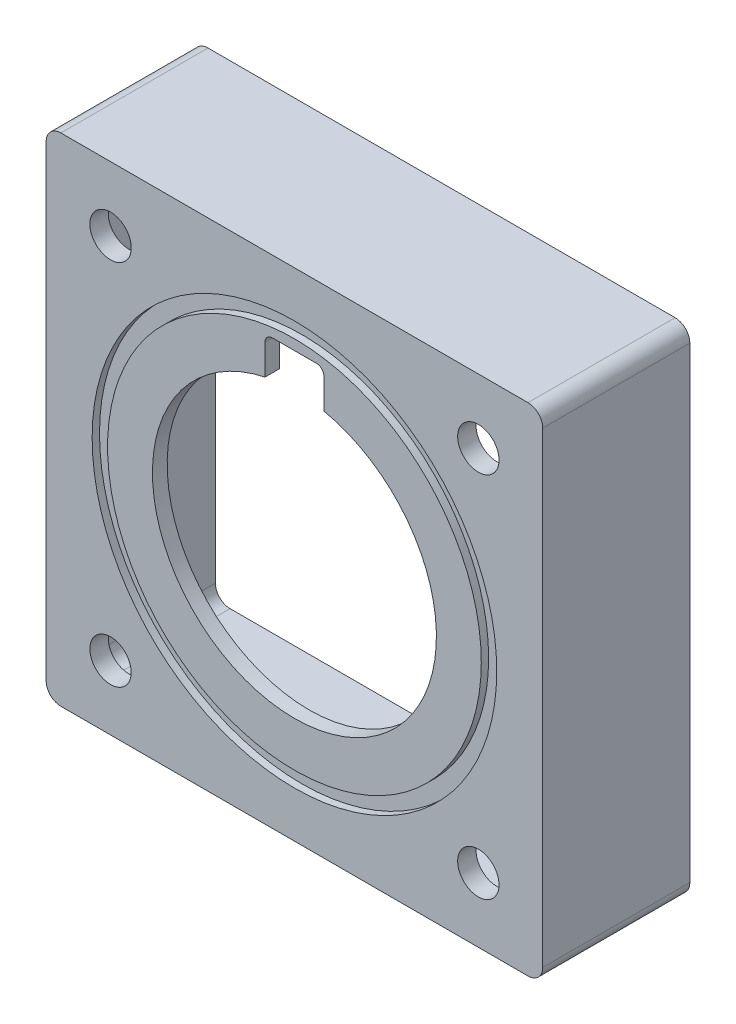
ISO-10303-21;
HEADER;
FILE_DESCRIPTION(('STEP AP214'),'2;1');
FILE_NAME('part.step','',(''),(''),'','','');
FILE_SCHEMA(('AUTOMOTIVE_DESIGN { 1 0 10303 214 1 1 1 1 }'));
ENDSEC;
DATA;
#1=APPLICATION_CONTEXT('core data for automotive mechanical design processes');
#2=APPLICATION_PROTOCOL_DEFINITION('international standard','automotive_design',2000,#1);
#3=PRODUCT_CONTEXT('',#1,'mechanical');
#4=PRODUCT('Part','Part','',(#3));
#5=PRODUCT_RELATED_PRODUCT_CATEGORY('part','',(#4));
#6=PRODUCT_DEFINITION_FORMATION('','',#4);
#7=PRODUCT_DEFINITION_CONTEXT('part definition',#1,'design');
#8=PRODUCT_DEFINITION('design','',#6,#7);
#9=PRODUCT_DEFINITION_SHAPE('','',#8);
#10=(LENGTH_UNIT() NAMED_UNIT(*) SI_UNIT(.MILLI.,.METRE.));
#11=(NAMED_UNIT(*) PLANE_ANGLE_UNIT() SI_UNIT($,.RADIAN.));
#12=(NAMED_UNIT(*) SI_UNIT($,.STERADIAN.) SOLID_ANGLE_UNIT());
#13=UNCERTAINTY_MEASURE_WITH_UNIT(LENGTH_MEASURE(1.E-05),#10,'distance_accuracy_value','');
#14=(GEOMETRIC_REPRESENTATION_CONTEXT(3) GLOBAL_UNCERTAINTY_ASSIGNED_CONTEXT((#13)) GLOBAL_UNIT_ASSIGNED_CONTEXT((#10,
#11,#12)) REPRESENTATION_CONTEXT('',''));
#15=CARTESIAN_POINT('',(0.,0.,0.));
#16=DIRECTION('',(0.,0.,1.));
#17=DIRECTION('',(1.,0.,0.));
#18=AXIS2_PLACEMENT_3D('',#15,#16,#17);
#19=CARTESIAN_POINT('',(0.,0.,25.4));
#20=DIRECTION('',(0.,0.,-1.));
#21=DIRECTION('',(-1.,0.,0.));
#22=AXIS2_PLACEMENT_3D('',#19,#20,#21);
#23=CYLINDRICAL_SURFACE('',#22,24.511);
#24=DIRECTION('',(0.,0.,-1.));
#25=VECTOR('',#24,1.);
#26=CARTESIAN_POINT('',(5.08,23.9787973218008,25.4));
#27=LINE('',#26,#25);
#28=CARTESIAN_POINT('',(5.08,23.9787973218008,22.86));
#29=VERTEX_POINT('',#28);
#30=CARTESIAN_POINT('',(5.08,23.9787973218008,25.4));
#31=VERTEX_POINT('',#30);
#32=EDGE_CURVE('E416',#29,#31,#27,.F.);
#33=ORIENTED_EDGE('',*,*,#32,.F.);
#34=CARTESIAN_POINT('',(0.,0.,22.86));
#35=DIRECTION('',(0.,0.,-1.));
#36=DIRECTION('',(-1.,0.,0.));
#37=AXIS2_PLACEMENT_3D('',#34,#35,#36);
#38=CIRCLE('',#37,24.511);
#39=CARTESIAN_POINT('',(-5.08,23.9787973218008,22.86));
#40=VERTEX_POINT('',#39);
#41=EDGE_CURVE('E54',#29,#40,#38,.T.);
#42=ORIENTED_EDGE('',*,*,#41,.T.);
#43=DIRECTION('',(0.,0.,-1.));
#44=VECTOR('',#43,1.);
#45=CARTESIAN_POINT('',(-5.08,23.9787973218008,25.4));
#46=LINE('',#45,#44);
#47=CARTESIAN_POINT('',(-5.08,23.9787973218008,25.4));
#48=VERTEX_POINT('',#47);
#49=EDGE_CURVE('E412',#48,#40,#46,.T.);
#50=ORIENTED_EDGE('',*,*,#49,.F.);
#51=CARTESIAN_POINT('',(0.,0.,25.4));
#52=DIRECTION('',(0.,0.,1.));
#53=DIRECTION('',(1.,0.,0.));
#54=AXIS2_PLACEMENT_3D('',#51,#52,#53);
#55=CIRCLE('',#54,24.511);
#56=EDGE_CURVE('E346',#48,#31,#55,.T.);
#57=ORIENTED_EDGE('',*,*,#56,.T.);
#58=EDGE_LOOP('',(#33,#42,#50,#57));
#59=FACE_BOUND('',#58,.T.);
#60=ADVANCED_FACE('F39',(#59),#23,.F.);
#61=CARTESIAN_POINT('',(0.,0.,25.4));
#62=DIRECTION('',(0.,0.,1.));
#63=DIRECTION('',(1.,0.,0.));
#64=AXIS2_PLACEMENT_3D('',#61,#62,#63);
#65=PLANE('',#64);
#66=DIRECTION('',(0.,-1.,0.));
#67=VECTOR('',#66,1.);
#68=CARTESIAN_POINT('',(-5.08,19.05,25.4));
#69=LINE('',#68,#67);
#70=CARTESIAN_POINT('',(-5.08,29.21,25.4));
#71=VERTEX_POINT('',#70);
#72=EDGE_CURVE('E218',#71,#48,#69,.T.);
#73=ORIENTED_EDGE('',*,*,#72,.F.);
#74=CARTESIAN_POINT('',(-3.81,29.21,25.4));
#75=DIRECTION('',(0.,0.,1.));
#76=DIRECTION('',(1.,0.,0.));
#77=AXIS2_PLACEMENT_3D('',#74,#75,#76);
#78=CIRCLE('',#77,1.27);
#79=CARTESIAN_POINT('',(-3.81,30.48,25.4));
#80=VERTEX_POINT('',#79);
#81=EDGE_CURVE('E62',#71,#80,#78,.F.);
#82=ORIENTED_EDGE('',*,*,#81,.T.);
#83=DIRECTION('',(-1.,0.,0.));
#84=VECTOR('',#83,1.);
#85=CARTESIAN_POINT('',(-5.08,30.48,25.4));
#86=LINE('',#85,#84);
#87=CARTESIAN_POINT('',(3.81,30.48,25.4));
#88=VERTEX_POINT('',#87);
#89=EDGE_CURVE('E418',#88,#80,#86,.T.);
#90=ORIENTED_EDGE('',*,*,#89,.F.);
#91=CARTESIAN_POINT('',(3.81,29.21,25.4));
#92=DIRECTION('',(0.,0.,1.));
#93=DIRECTION('',(1.,0.,0.));
#94=AXIS2_PLACEMENT_3D('',#91,#92,#93);
#95=CIRCLE('',#94,1.27);
#96=CARTESIAN_POINT('',(5.08,29.21,25.4));
#97=VERTEX_POINT('',#96);
#98=EDGE_CURVE('E241',#88,#97,#95,.F.);
#99=ORIENTED_EDGE('',*,*,#98,.T.);
#100=DIRECTION('',(0.,1.,0.));
#101=VECTOR('',#100,1.);
#102=CARTESIAN_POINT('',(5.08,30.48,25.4));
#103=LINE('',#102,#101);
#104=EDGE_CURVE('E421',#31,#97,#103,.T.);
#105=ORIENTED_EDGE('',*,*,#104,.F.);
#106=ORIENTED_EDGE('',*,*,#56,.F.);
#107=EDGE_LOOP('',(#73,#82,#90,#99,#105,#106));
#108=FACE_BOUND('',#107,.T.);
#109=CARTESIAN_POINT('',(0.,0.,25.4));
#110=DIRECTION('',(0.,0.,1.));
#111=DIRECTION('',(1.,0.,0.));
#112=AXIS2_PLACEMENT_3D('',#109,#110,#111);
#113=CIRCLE('',#112,32.258);
#114=CARTESIAN_POINT('',(32.258,0.,25.4));
#115=VERTEX_POINT('',#114);
#116=EDGE_CURVE('E409',#115,#115,#113,.T.);
#117=ORIENTED_EDGE('',*,*,#116,.T.);
#118=EDGE_LOOP('',(#117));
#119=FACE_BOUND('',#118,.T.);
#120=ADVANCED_FACE('F430',(#108,#119),#65,.T.);
#121=CARTESIAN_POINT('',(0.,0.,25.4));
#122=DIRECTION('',(0.,0.,1.));
#123=DIRECTION('',(1.,0.,0.));
#124=AXIS2_PLACEMENT_3D('',#121,#122,#123);
#125=CIRCLE('',#124,34.925);
#126=CARTESIAN_POINT('',(34.925,0.,25.4));
#127=VERTEX_POINT('',#126);
#128=EDGE_CURVE('E403',#127,#127,#125,.T.);
#129=ORIENTED_EDGE('',*,*,#128,.F.);
#130=EDGE_LOOP('',(#129));
#131=FACE_BOUND('',#130,.T.);
#132=CARTESIAN_POINT('',(31.75,31.7499999999996,25.4));
#133=DIRECTION('',(0.,0.,-1.));
#134=DIRECTION('',(-1.,0.,0.));
#135=AXIS2_PLACEMENT_3D('',#132,#133,#134);
#136=CIRCLE('',#135,3.57245345743552);
#137=CARTESIAN_POINT('',(28.1775465425645,31.7499999999996,25.4));
#138=VERTEX_POINT('',#137);
#139=EDGE_CURVE('E362',#138,#138,#136,.T.);
#140=ORIENTED_EDGE('',*,*,#139,.T.);
#141=EDGE_LOOP('',(#140));
#142=FACE_BOUND('',#141,.T.);
#143=CARTESIAN_POINT('',(-31.75,31.7499999999996,25.4));
#144=DIRECTION('',(0.,0.,1.));
#145=DIRECTION('',(1.,0.,0.));
#146=AXIS2_PLACEMENT_3D('',#143,#144,#145);
#147=CIRCLE('',#146,3.57245345743552);
#148=CARTESIAN_POINT('',(-28.1775465425645,31.7499999999996,25.4));
#149=VERTEX_POINT('',#148);
#150=EDGE_CURVE('E359',#149,#149,#147,.T.);
#151=ORIENTED_EDGE('',*,*,#150,.F.);
#152=EDGE_LOOP('',(#151));
#153=FACE_BOUND('',#152,.T.);
#154=DIRECTION('',(1.,0.,0.));
#155=VECTOR('',#154,1.);
#156=CARTESIAN_POINT('',(-42.8625,-42.8625,25.4));
#157=LINE('',#156,#155);
#158=CARTESIAN_POINT('',(-40.3225,-42.8625,25.4));
#159=VERTEX_POINT('',#158);
#160=CARTESIAN_POINT('',(40.3225,-42.8625,25.4));
#161=VERTEX_POINT('',#160);
#162=EDGE_CURVE('E352',#159,#161,#157,.T.);
#163=ORIENTED_EDGE('',*,*,#162,.T.);
#164=CARTESIAN_POINT('',(40.3225,-40.3225,25.4));
#165=DIRECTION('',(0.,0.,1.));
#166=DIRECTION('',(1.,0.,0.));
#167=AXIS2_PLACEMENT_3D('',#164,#165,#166);
#168=CIRCLE('',#167,2.54);
#169=CARTESIAN_POINT('',(42.8625,-40.3225,25.4));
#170=VERTEX_POINT('',#169);
#171=EDGE_CURVE('E301',#161,#170,#168,.T.);
#172=ORIENTED_EDGE('',*,*,#171,.T.);
#173=DIRECTION('',(0.,1.,0.));
#174=VECTOR('',#173,1.);
#175=CARTESIAN_POINT('',(42.8625,42.8625,25.4));
#176=LINE('',#175,#174);
#177=CARTESIAN_POINT('',(42.8625,40.3225,25.4));
#178=VERTEX_POINT('',#177);
#179=EDGE_CURVE('E349',#170,#178,#176,.T.);
#180=ORIENTED_EDGE('',*,*,#179,.T.);
#181=CARTESIAN_POINT('',(40.3225,40.3225,25.4));
#182=DIRECTION('',(0.,0.,1.));
#183=DIRECTION('',(1.,0.,0.));
#184=AXIS2_PLACEMENT_3D('',#181,#182,#183);
#185=CIRCLE('',#184,2.54);
#186=CARTESIAN_POINT('',(40.3225,42.8625,25.4));
#187=VERTEX_POINT('',#186);
#188=EDGE_CURVE('E307',#178,#187,#185,.T.);
#189=ORIENTED_EDGE('',*,*,#188,.T.);
#190=DIRECTION('',(-1.,0.,0.));
#191=VECTOR('',#190,1.);
#192=CARTESIAN_POINT('',(-42.8625,42.8625,25.4));
#193=LINE('',#192,#191);
#194=CARTESIAN_POINT('',(-40.3225,42.8625,25.4));
#195=VERTEX_POINT('',#194);
#196=EDGE_CURVE('E327',#187,#195,#193,.T.);
#197=ORIENTED_EDGE('',*,*,#196,.T.);
#198=CARTESIAN_POINT('',(-40.3225,40.3225,25.4));
#199=DIRECTION('',(0.,0.,1.));
#200=DIRECTION('',(1.,0.,0.));
#201=AXIS2_PLACEMENT_3D('',#198,#199,#200);
#202=CIRCLE('',#201,2.54);
#203=CARTESIAN_POINT('',(-42.8625,40.3225,25.4));
#204=VERTEX_POINT('',#203);
#205=EDGE_CURVE('E305',#195,#204,#202,.T.);
#206=ORIENTED_EDGE('',*,*,#205,.T.);
#207=DIRECTION('',(0.,-1.,0.));
#208=VECTOR('',#207,1.);
#209=CARTESIAN_POINT('',(-42.8625,42.8625,25.4));
#210=LINE('',#209,#208);
#211=CARTESIAN_POINT('',(-42.8625,-40.3225,25.4));
#212=VERTEX_POINT('',#211);
#213=EDGE_CURVE('E336',#204,#212,#210,.T.);
#214=ORIENTED_EDGE('',*,*,#213,.T.);
#215=CARTESIAN_POINT('',(-40.3225,-40.3225,25.4));
#216=DIRECTION('',(0.,0.,1.));
#217=DIRECTION('',(1.,0.,0.));
#218=AXIS2_PLACEMENT_3D('',#215,#216,#217);
#219=CIRCLE('',#218,2.54);
#220=EDGE_CURVE('E303',#212,#159,#219,.T.);
#221=ORIENTED_EDGE('',*,*,#220,.T.);
#222=EDGE_LOOP('',(#163,#172,#180,#189,#197,#206,#214,#221));
#223=FACE_BOUND('',#222,.T.);
#224=CARTESIAN_POINT('',(31.75,-31.7499999999996,25.4));
#225=DIRECTION('',(0.,0.,1.));
#226=DIRECTION('',(-1.,0.,0.));
#227=AXIS2_PLACEMENT_3D('',#224,#225,#226);
#228=CIRCLE('',#227,3.57245345743552);
#229=CARTESIAN_POINT('',(28.1775465425645,-31.7499999999996,25.4));
#230=VERTEX_POINT('',#229);
#231=EDGE_CURVE('E365',#230,#230,#228,.T.);
#232=ORIENTED_EDGE('',*,*,#231,.F.);
#233=EDGE_LOOP('',(#232));
#234=FACE_BOUND('',#233,.T.);
#235=CARTESIAN_POINT('',(-31.75,-31.7499999999996,25.4));
#236=DIRECTION('',(0.,0.,-1.));
#237=DIRECTION('',(1.,0.,0.));
#238=AXIS2_PLACEMENT_3D('',#235,#236,#237);
#239=CIRCLE('',#238,3.57245345743552);
#240=CARTESIAN_POINT('',(-28.1775465425645,-31.7499999999996,25.4));
#241=VERTEX_POINT('',#240);
#242=EDGE_CURVE('E368',#241,#241,#239,.T.);
#243=ORIENTED_EDGE('',*,*,#242,.T.);
#244=EDGE_LOOP('',(#243));
#245=FACE_BOUND('',#244,.T.);
#246=ADVANCED_FACE('F451',(#131,#142,#153,#223,#234,#245),#65,.T.);
#247=CARTESIAN_POINT('',(0.,0.,0.));
#248=DIRECTION('',(0.,0.,1.));
#249=DIRECTION('',(1.,0.,0.));
#250=AXIS2_PLACEMENT_3D('',#247,#248,#249);
#251=PLANE('',#250);
#252=DIRECTION('',(0.,1.,0.));
#253=VECTOR('',#252,1.);
#254=CARTESIAN_POINT('',(-39.0525,39.0525,0.));
#255=LINE('',#254,#253);
#256=CARTESIAN_POINT('',(-39.0525,-36.5125,0.));
#257=VERTEX_POINT('',#256);
#258=CARTESIAN_POINT('',(-39.0525,36.5125,0.));
#259=VERTEX_POINT('',#258);
#260=EDGE_CURVE('E398',#257,#259,#255,.T.);
#261=ORIENTED_EDGE('',*,*,#260,.F.);
#262=CARTESIAN_POINT('',(-36.5125,-36.5125,0.));
#263=DIRECTION('',(0.,0.,1.));
#264=DIRECTION('',(1.,0.,0.));
#265=AXIS2_PLACEMENT_3D('',#262,#263,#264);
#266=CIRCLE('',#265,2.54);
#267=CARTESIAN_POINT('',(-36.5125,-39.0525,0.));
#268=VERTEX_POINT('',#267);
#269=EDGE_CURVE('E255',#257,#268,#266,.T.);
#270=ORIENTED_EDGE('',*,*,#269,.T.);
#271=DIRECTION('',(-1.,0.,0.));
#272=VECTOR('',#271,1.);
#273=CARTESIAN_POINT('',(39.0525,-39.0525,0.));
#274=LINE('',#273,#272);
#275=CARTESIAN_POINT('',(36.5125,-39.0525,0.));
#276=VERTEX_POINT('',#275);
#277=EDGE_CURVE('E394',#276,#268,#274,.T.);
#278=ORIENTED_EDGE('',*,*,#277,.F.);
#279=CARTESIAN_POINT('',(36.5125,-36.5125,0.));
#280=DIRECTION('',(0.,0.,1.));
#281=DIRECTION('',(1.,0.,0.));
#282=AXIS2_PLACEMENT_3D('',#279,#280,#281);
#283=CIRCLE('',#282,2.54);
#284=CARTESIAN_POINT('',(39.0525,-36.5125,0.));
#285=VERTEX_POINT('',#284);
#286=EDGE_CURVE('E259',#276,#285,#283,.T.);
#287=ORIENTED_EDGE('',*,*,#286,.T.);
#288=DIRECTION('',(0.,-1.,0.));
#289=VECTOR('',#288,1.);
#290=CARTESIAN_POINT('',(39.0525,39.0525,0.));
#291=LINE('',#290,#289);
#292=CARTESIAN_POINT('',(39.0525,36.5125,0.));
#293=VERTEX_POINT('',#292);
#294=EDGE_CURVE('E391',#293,#285,#291,.T.);
#295=ORIENTED_EDGE('',*,*,#294,.F.);
#296=CARTESIAN_POINT('',(36.5125,36.5125,0.));
#297=DIRECTION('',(0.,0.,1.));
#298=DIRECTION('',(1.,0.,0.));
#299=AXIS2_PLACEMENT_3D('',#296,#297,#298);
#300=CIRCLE('',#299,2.54);
#301=CARTESIAN_POINT('',(36.5125,39.0525,0.));
#302=VERTEX_POINT('',#301);
#303=EDGE_CURVE('E261',#293,#302,#300,.T.);
#304=ORIENTED_EDGE('',*,*,#303,.T.);
#305=DIRECTION('',(1.,0.,0.));
#306=VECTOR('',#305,1.);
#307=CARTESIAN_POINT('',(39.0525,39.0525,0.));
#308=LINE('',#307,#306);
#309=CARTESIAN_POINT('',(-36.5125,39.0525,0.));
#310=VERTEX_POINT('',#309);
#311=EDGE_CURVE('E390',#310,#302,#308,.T.);
#312=ORIENTED_EDGE('',*,*,#311,.F.);
#313=CARTESIAN_POINT('',(-36.5125,36.5125,0.));
#314=DIRECTION('',(0.,0.,1.));
#315=DIRECTION('',(1.,0.,0.));
#316=AXIS2_PLACEMENT_3D('',#313,#314,#315);
#317=CIRCLE('',#316,2.54);
#318=EDGE_CURVE('E254',#310,#259,#317,.T.);
#319=ORIENTED_EDGE('',*,*,#318,.T.);
#320=EDGE_LOOP('',(#261,#270,#278,#287,#295,#304,#312,#319));
#321=FACE_BOUND('',#320,.T.);
#322=DIRECTION('',(0.,1.,0.));
#323=VECTOR('',#322,1.);
#324=CARTESIAN_POINT('',(42.8625,42.8625,0.));
#325=LINE('',#324,#323);
#326=CARTESIAN_POINT('',(42.8625,-40.3225,0.));
#327=VERTEX_POINT('',#326);
#328=CARTESIAN_POINT('',(42.8625,40.3225,0.));
#329=VERTEX_POINT('',#328);
#330=EDGE_CURVE('E337',#327,#329,#325,.T.);
#331=ORIENTED_EDGE('',*,*,#330,.F.);
#332=CARTESIAN_POINT('',(40.3225,-40.3225,0.));
#333=DIRECTION('',(0.,0.,1.));
#334=DIRECTION('',(1.,0.,0.));
#335=AXIS2_PLACEMENT_3D('',#332,#333,#334);
#336=CIRCLE('',#335,2.54);
#337=CARTESIAN_POINT('',(40.3225,-42.8625,0.));
#338=VERTEX_POINT('',#337);
#339=EDGE_CURVE('E314',#327,#338,#336,.F.);
#340=ORIENTED_EDGE('',*,*,#339,.T.);
#341=DIRECTION('',(1.,0.,0.));
#342=VECTOR('',#341,1.);
#343=CARTESIAN_POINT('',(-42.8625,-42.8625,0.));
#344=LINE('',#343,#342);
#345=CARTESIAN_POINT('',(-40.3225,-42.8625,0.));
#346=VERTEX_POINT('',#345);
#347=EDGE_CURVE('E340',#346,#338,#344,.T.);
#348=ORIENTED_EDGE('',*,*,#347,.F.);
#349=CARTESIAN_POINT('',(-40.3225,-40.3225,0.));
#350=DIRECTION('',(0.,0.,1.));
#351=DIRECTION('',(1.,0.,0.));
#352=AXIS2_PLACEMENT_3D('',#349,#350,#351);
#353=CIRCLE('',#352,2.54);
#354=CARTESIAN_POINT('',(-42.8625,-40.3225,0.));
#355=VERTEX_POINT('',#354);
#356=EDGE_CURVE('E316',#346,#355,#353,.F.);
#357=ORIENTED_EDGE('',*,*,#356,.T.);
#358=DIRECTION('',(0.,-1.,0.));
#359=VECTOR('',#358,1.);
#360=CARTESIAN_POINT('',(-42.8625,42.8625,0.));
#361=LINE('',#360,#359);
#362=CARTESIAN_POINT('',(-42.8625,40.3225,0.));
#363=VERTEX_POINT('',#362);
#364=EDGE_CURVE('E343',#363,#355,#361,.T.);
#365=ORIENTED_EDGE('',*,*,#364,.F.);
#366=CARTESIAN_POINT('',(-40.3225,40.3225,0.));
#367=DIRECTION('',(0.,0.,1.));
#368=DIRECTION('',(1.,0.,0.));
#369=AXIS2_PLACEMENT_3D('',#366,#367,#368);
#370=CIRCLE('',#369,2.54);
#371=CARTESIAN_POINT('',(-40.3225,42.8625,0.));
#372=VERTEX_POINT('',#371);
#373=EDGE_CURVE('E318',#363,#372,#370,.F.);
#374=ORIENTED_EDGE('',*,*,#373,.T.);
#375=DIRECTION('',(-1.,0.,0.));
#376=VECTOR('',#375,1.);
#377=CARTESIAN_POINT('',(-42.8625,42.8625,0.));
#378=LINE('',#377,#376);
#379=CARTESIAN_POINT('',(40.3225,42.8625,0.));
#380=VERTEX_POINT('',#379);
#381=EDGE_CURVE('E333',#380,#372,#378,.T.);
#382=ORIENTED_EDGE('',*,*,#381,.F.);
#383=CARTESIAN_POINT('',(40.3225,40.3225,0.));
#384=DIRECTION('',(0.,0.,1.));
#385=DIRECTION('',(1.,0.,0.));
#386=AXIS2_PLACEMENT_3D('',#383,#384,#385);
#387=CIRCLE('',#386,2.54);
#388=EDGE_CURVE('E320',#380,#329,#387,.F.);
#389=ORIENTED_EDGE('',*,*,#388,.T.);
#390=EDGE_LOOP('',(#331,#340,#348,#357,#365,#374,#382,#389));
#391=FACE_BOUND('',#390,.T.);
#392=ADVANCED_FACE('F458',(#321,#391),#251,.F.);
#393=CARTESIAN_POINT('',(-42.8625,42.8625,25.4));
#394=DIRECTION('',(1.,0.,0.));
#395=DIRECTION('',(0.,1.,0.));
#396=AXIS2_PLACEMENT_3D('',#393,#394,#395);
#397=PLANE('',#396);
#398=ORIENTED_EDGE('',*,*,#364,.T.);
#399=DIRECTION('',(0.,0.,-1.));
#400=VECTOR('',#399,1.);
#401=CARTESIAN_POINT('',(-42.8625,-40.3225,25.4));
#402=LINE('',#401,#400);
#403=EDGE_CURVE('E296',#355,#212,#402,.F.);
#404=ORIENTED_EDGE('',*,*,#403,.T.);
#405=ORIENTED_EDGE('',*,*,#213,.F.);
#406=DIRECTION('',(0.,0.,-1.));
#407=VECTOR('',#406,1.);
#408=CARTESIAN_POINT('',(-42.8625,40.3225,25.4));
#409=LINE('',#408,#407);
#410=EDGE_CURVE('E298',#204,#363,#409,.T.);
#411=ORIENTED_EDGE('',*,*,#410,.T.);
#412=EDGE_LOOP('',(#398,#404,#405,#411));
#413=FACE_BOUND('',#412,.T.);
#414=ADVANCED_FACE('F462',(#413),#397,.F.);
#415=CARTESIAN_POINT('',(-42.8625,-42.8625,25.4));
#416=DIRECTION('',(0.,1.,0.));
#417=DIRECTION('',(-1.,0.,0.));
#418=AXIS2_PLACEMENT_3D('',#415,#416,#417);
#419=PLANE('',#418);
#420=ORIENTED_EDGE('',*,*,#347,.T.);
#421=DIRECTION('',(0.,0.,-1.));
#422=VECTOR('',#421,1.);
#423=CARTESIAN_POINT('',(40.3225,-42.8625,25.4));
#424=LINE('',#423,#422);
#425=EDGE_CURVE('E309',#338,#161,#424,.F.);
#426=ORIENTED_EDGE('',*,*,#425,.T.);
#427=ORIENTED_EDGE('',*,*,#162,.F.);
#428=DIRECTION('',(0.,0.,-1.));
#429=VECTOR('',#428,1.);
#430=CARTESIAN_POINT('',(-40.3225,-42.8625,25.4));
#431=LINE('',#430,#429);
#432=EDGE_CURVE('E311',#159,#346,#431,.T.);
#433=ORIENTED_EDGE('',*,*,#432,.T.);
#434=EDGE_LOOP('',(#420,#426,#427,#433));
#435=FACE_BOUND('',#434,.T.);
#436=ADVANCED_FACE('F471',(#435),#419,.F.);
#437=CARTESIAN_POINT('',(42.8625,42.8625,25.4));
#438=DIRECTION('',(-1.,0.,0.));
#439=DIRECTION('',(0.,-1.,0.));
#440=AXIS2_PLACEMENT_3D('',#437,#438,#439);
#441=PLANE('',#440);
#442=ORIENTED_EDGE('',*,*,#179,.F.);
#443=DIRECTION('',(0.,0.,-1.));
#444=VECTOR('',#443,1.);
#445=CARTESIAN_POINT('',(42.8625,-40.3225,25.4));
#446=LINE('',#445,#444);
#447=EDGE_CURVE('E322',#170,#327,#446,.T.);
#448=ORIENTED_EDGE('',*,*,#447,.T.);
#449=ORIENTED_EDGE('',*,*,#330,.T.);
#450=DIRECTION('',(0.,0.,-1.));
#451=VECTOR('',#450,1.);
#452=CARTESIAN_POINT('',(42.8625,40.3225,25.4));
#453=LINE('',#452,#451);
#454=EDGE_CURVE('E325',#329,#178,#453,.F.);
#455=ORIENTED_EDGE('',*,*,#454,.T.);
#456=EDGE_LOOP('',(#442,#448,#449,#455));
#457=FACE_BOUND('',#456,.T.);
#458=ADVANCED_FACE('F467',(#457),#441,.F.);
#459=CARTESIAN_POINT('',(-42.8625,42.8625,25.4));
#460=DIRECTION('',(0.,-1.,0.));
#461=DIRECTION('',(0.,0.,-1.));
#462=AXIS2_PLACEMENT_3D('',#459,#460,#461);
#463=PLANE('',#462);
#464=ORIENTED_EDGE('',*,*,#381,.T.);
#465=DIRECTION('',(0.,0.,-1.));
#466=VECTOR('',#465,1.);
#467=CARTESIAN_POINT('',(-40.3225,42.8625,25.4));
#468=LINE('',#467,#466);
#469=EDGE_CURVE('E291',#372,#195,#468,.F.);
#470=ORIENTED_EDGE('',*,*,#469,.T.);
#471=ORIENTED_EDGE('',*,*,#196,.F.);
#472=DIRECTION('',(0.,0.,-1.));
#473=VECTOR('',#472,1.);
#474=CARTESIAN_POINT('',(40.3225,42.8625,25.4));
#475=LINE('',#474,#473);
#476=EDGE_CURVE('E293',#187,#380,#475,.T.);
#477=ORIENTED_EDGE('',*,*,#476,.T.);
#478=EDGE_LOOP('',(#464,#470,#471,#477));
#479=FACE_BOUND('',#478,.T.);
#480=ADVANCED_FACE('F464',(#479),#463,.F.);
#481=CARTESIAN_POINT('',(-31.75,31.7499999999996,0.));
#482=DIRECTION('',(0.,0.,1.));
#483=DIRECTION('',(1.,0.,0.));
#484=AXIS2_PLACEMENT_3D('',#481,#482,#483);
#485=CYLINDRICAL_SURFACE('',#484,3.57245345743552);
#486=CARTESIAN_POINT('',(-31.75,31.7499999999996,22.225));
#487=DIRECTION('',(0.,0.,1.));
#488=DIRECTION('',(1.,0.,0.));
#489=AXIS2_PLACEMENT_3D('',#486,#487,#488);
#490=CIRCLE('',#489,3.57245345743552);
#491=CARTESIAN_POINT('',(-28.1775465425645,31.7499999999996,22.225));
#492=VERTEX_POINT('',#491);
#493=EDGE_CURVE('E371',#492,#492,#490,.F.);
#494=ORIENTED_EDGE('',*,*,#493,.T.);
#495=EDGE_LOOP('',(#494));
#496=FACE_BOUND('',#495,.T.);
#497=ORIENTED_EDGE('',*,*,#150,.T.);
#498=EDGE_LOOP('',(#497));
#499=FACE_BOUND('',#498,.T.);
#500=ADVANCED_FACE('F454',(#496,#499),#485,.F.);
#501=CARTESIAN_POINT('',(31.75,31.7499999999996,0.));
#502=DIRECTION('',(0.,0.,1.));
#503=DIRECTION('',(1.,0.,0.));
#504=AXIS2_PLACEMENT_3D('',#501,#502,#503);
#505=CYLINDRICAL_SURFACE('',#504,3.57245345743552);
#506=CARTESIAN_POINT('',(31.75,31.7499999999996,22.225));
#507=DIRECTION('',(0.,0.,1.));
#508=DIRECTION('',(1.,0.,0.));
#509=AXIS2_PLACEMENT_3D('',#506,#507,#508);
#510=CIRCLE('',#509,3.57245345743552);
#511=CARTESIAN_POINT('',(35.3224534574355,31.7499999999996,22.225));
#512=VERTEX_POINT('',#511);
#513=EDGE_CURVE('E374',#512,#512,#510,.T.);
#514=ORIENTED_EDGE('',*,*,#513,.F.);
#515=EDGE_LOOP('',(#514));
#516=FACE_BOUND('',#515,.T.);
#517=ORIENTED_EDGE('',*,*,#139,.F.);
#518=EDGE_LOOP('',(#517));
#519=FACE_BOUND('',#518,.T.);
#520=ADVANCED_FACE('F584',(#516,#519),#505,.F.);
#521=CARTESIAN_POINT('',(31.75,-31.7499999999996,0.));
#522=DIRECTION('',(0.,0.,1.));
#523=DIRECTION('',(1.,0.,0.));
#524=AXIS2_PLACEMENT_3D('',#521,#522,#523);
#525=CYLINDRICAL_SURFACE('',#524,3.57245345743552);
#526=CARTESIAN_POINT('',(31.75,-31.7499999999996,22.225));
#527=DIRECTION('',(0.,0.,1.));
#528=DIRECTION('',(1.,0.,0.));
#529=AXIS2_PLACEMENT_3D('',#526,#527,#528);
#530=CIRCLE('',#529,3.57245345743552);
#531=CARTESIAN_POINT('',(35.3224534574355,-31.7499999999996,22.225));
#532=VERTEX_POINT('',#531);
#533=EDGE_CURVE('E331',#532,#532,#530,.F.);
#534=ORIENTED_EDGE('',*,*,#533,.T.);
#535=EDGE_LOOP('',(#534));
#536=FACE_BOUND('',#535,.T.);
#537=ORIENTED_EDGE('',*,*,#231,.T.);
#538=EDGE_LOOP('',(#537));
#539=FACE_BOUND('',#538,.T.);
#540=ADVANCED_FACE('F576',(#536,#539),#525,.F.);
#541=CARTESIAN_POINT('',(-31.75,-31.7499999999996,0.));
#542=DIRECTION('',(0.,0.,1.));
#543=DIRECTION('',(1.,0.,0.));
#544=AXIS2_PLACEMENT_3D('',#541,#542,#543);
#545=CYLINDRICAL_SURFACE('',#544,3.57245345743552);
#546=CARTESIAN_POINT('',(-31.75,-31.7499999999996,22.225));
#547=DIRECTION('',(0.,0.,1.));
#548=DIRECTION('',(1.,0.,0.));
#549=AXIS2_PLACEMENT_3D('',#546,#547,#548);
#550=CIRCLE('',#549,3.57245345743552);
#551=CARTESIAN_POINT('',(-28.1775465425645,-31.7499999999996,22.225));
#552=VERTEX_POINT('',#551);
#553=EDGE_CURVE('E328',#552,#552,#550,.T.);
#554=ORIENTED_EDGE('',*,*,#553,.F.);
#555=EDGE_LOOP('',(#554));
#556=FACE_BOUND('',#555,.T.);
#557=ORIENTED_EDGE('',*,*,#242,.F.);
#558=EDGE_LOOP('',(#557));
#559=FACE_BOUND('',#558,.T.);
#560=ADVANCED_FACE('F574',(#556,#559),#545,.F.);
#561=CARTESIAN_POINT('',(0.,0.,22.225));
#562=DIRECTION('',(0.,0.,1.));
#563=DIRECTION('',(1.,0.,0.));
#564=AXIS2_PLACEMENT_3D('',#561,#562,#563);
#565=PLANE('',#564);
#566=DIRECTION('',(0.,-1.,0.));
#567=VECTOR('',#566,1.);
#568=CARTESIAN_POINT('',(-5.08,0.,22.225));
#569=LINE('',#568,#567);
#570=CARTESIAN_POINT('',(-5.08,29.21,22.225));
#571=VERTEX_POINT('',#570);
#572=CARTESIAN_POINT('',(-5.08,28.1585349691705,22.225));
#573=VERTEX_POINT('',#572);
#574=EDGE_CURVE('E215',#571,#573,#569,.T.);
#575=ORIENTED_EDGE('',*,*,#574,.T.);
#576=CARTESIAN_POINT('',(0.,0.,22.225));
#577=DIRECTION('',(0.,0.,-1.));
#578=DIRECTION('',(-1.,0.,0.));
#579=AXIS2_PLACEMENT_3D('',#576,#577,#578);
#580=CIRCLE('',#579,28.6131);
#581=CARTESIAN_POINT('',(5.08,28.1585349691705,22.225));
#582=VERTEX_POINT('',#581);
#583=EDGE_CURVE('E200',#582,#573,#580,.T.);
#584=ORIENTED_EDGE('',*,*,#583,.F.);
#585=DIRECTION('',(0.,1.,0.));
#586=VECTOR('',#585,1.);
#587=CARTESIAN_POINT('',(5.08,0.,22.225));
#588=LINE('',#587,#586);
#589=CARTESIAN_POINT('',(5.08,29.21,22.225));
#590=VERTEX_POINT('',#589);
#591=EDGE_CURVE('E230',#582,#590,#588,.T.);
#592=ORIENTED_EDGE('',*,*,#591,.T.);
#593=CARTESIAN_POINT('',(3.81,29.21,22.225));
#594=DIRECTION('',(0.,0.,1.));
#595=DIRECTION('',(1.,0.,0.));
#596=AXIS2_PLACEMENT_3D('',#593,#594,#595);
#597=CIRCLE('',#596,1.27);
#598=CARTESIAN_POINT('',(3.81,30.48,22.225));
#599=VERTEX_POINT('',#598);
#600=EDGE_CURVE('E243',#590,#599,#597,.T.);
#601=ORIENTED_EDGE('',*,*,#600,.T.);
#602=DIRECTION('',(-1.,0.,0.));
#603=VECTOR('',#602,1.);
#604=CARTESIAN_POINT('',(0.,30.48,22.225));
#605=LINE('',#604,#603);
#606=CARTESIAN_POINT('',(-3.81,30.48,22.225));
#607=VERTEX_POINT('',#606);
#608=EDGE_CURVE('E226',#599,#607,#605,.T.);
#609=ORIENTED_EDGE('',*,*,#608,.T.);
#610=CARTESIAN_POINT('',(-3.81,29.21,22.225));
#611=DIRECTION('',(0.,0.,1.));
#612=DIRECTION('',(1.,0.,0.));
#613=AXIS2_PLACEMENT_3D('',#610,#611,#612);
#614=CIRCLE('',#613,1.27);
#615=EDGE_CURVE('E224',#607,#571,#614,.T.);
#616=ORIENTED_EDGE('',*,*,#615,.T.);
#617=EDGE_LOOP('',(#575,#584,#592,#601,#609,#616));
#618=FACE_BOUND('',#617,.T.);
#619=ORIENTED_EDGE('',*,*,#533,.F.);
#620=EDGE_LOOP('',(#619));
#621=FACE_BOUND('',#620,.T.);
#622=ORIENTED_EDGE('',*,*,#553,.T.);
#623=EDGE_LOOP('',(#622));
#624=FACE_BOUND('',#623,.T.);
#625=DIRECTION('',(1.,0.,0.));
#626=VECTOR('',#625,1.);
#627=CARTESIAN_POINT('',(39.0525,39.0525,22.225));
#628=LINE('',#627,#626);
#629=CARTESIAN_POINT('',(-36.5125,39.0525,22.225));
#630=VERTEX_POINT('',#629);
#631=CARTESIAN_POINT('',(36.5125,39.0525,22.225));
#632=VERTEX_POINT('',#631);
#633=EDGE_CURVE('E382',#630,#632,#628,.T.);
#634=ORIENTED_EDGE('',*,*,#633,.T.);
#635=CARTESIAN_POINT('',(36.5125,36.5125,22.225));
#636=DIRECTION('',(0.,0.,1.));
#637=DIRECTION('',(1.,0.,0.));
#638=AXIS2_PLACEMENT_3D('',#635,#636,#637);
#639=CIRCLE('',#638,2.54);
#640=CARTESIAN_POINT('',(39.0525,36.5125,22.225));
#641=VERTEX_POINT('',#640);
#642=EDGE_CURVE('E273',#632,#641,#639,.F.);
#643=ORIENTED_EDGE('',*,*,#642,.T.);
#644=DIRECTION('',(0.,-1.,0.));
#645=VECTOR('',#644,1.);
#646=CARTESIAN_POINT('',(39.0525,39.0525,22.225));
#647=LINE('',#646,#645);
#648=CARTESIAN_POINT('',(39.0525,-36.5125,22.225));
#649=VERTEX_POINT('',#648);
#650=EDGE_CURVE('E332',#641,#649,#647,.T.);
#651=ORIENTED_EDGE('',*,*,#650,.T.);
#652=CARTESIAN_POINT('',(36.5125,-36.5125,22.225));
#653=DIRECTION('',(0.,0.,1.));
#654=DIRECTION('',(1.,0.,0.));
#655=AXIS2_PLACEMENT_3D('',#652,#653,#654);
#656=CIRCLE('',#655,2.54);
#657=CARTESIAN_POINT('',(36.5125,-39.0525,22.225));
#658=VERTEX_POINT('',#657);
#659=EDGE_CURVE('E275',#649,#658,#656,.F.);
#660=ORIENTED_EDGE('',*,*,#659,.T.);
#661=DIRECTION('',(-1.,0.,0.));
#662=VECTOR('',#661,1.);
#663=CARTESIAN_POINT('',(39.0525,-39.0525,22.225));
#664=LINE('',#663,#662);
#665=CARTESIAN_POINT('',(-36.5125,-39.0525,22.225));
#666=VERTEX_POINT('',#665);
#667=EDGE_CURVE('E383',#658,#666,#664,.T.);
#668=ORIENTED_EDGE('',*,*,#667,.T.);
#669=CARTESIAN_POINT('',(-36.5125,-36.5125,22.225));
#670=DIRECTION('',(0.,0.,1.));
#671=DIRECTION('',(1.,0.,0.));
#672=AXIS2_PLACEMENT_3D('',#669,#670,#671);
#673=CIRCLE('',#672,2.54);
#674=CARTESIAN_POINT('',(-39.0525,-36.5125,22.225));
#675=VERTEX_POINT('',#674);
#676=EDGE_CURVE('E277',#666,#675,#673,.F.);
#677=ORIENTED_EDGE('',*,*,#676,.T.);
#678=DIRECTION('',(0.,1.,0.));
#679=VECTOR('',#678,1.);
#680=CARTESIAN_POINT('',(-39.0525,39.0525,22.225));
#681=LINE('',#680,#679);
#682=CARTESIAN_POINT('',(-39.0525,36.5125,22.225));
#683=VERTEX_POINT('',#682);
#684=EDGE_CURVE('E379',#675,#683,#681,.T.);
#685=ORIENTED_EDGE('',*,*,#684,.T.);
#686=CARTESIAN_POINT('',(-36.5125,36.5125,22.225));
#687=DIRECTION('',(0.,0.,1.));
#688=DIRECTION('',(1.,0.,0.));
#689=AXIS2_PLACEMENT_3D('',#686,#687,#688);
#690=CIRCLE('',#689,2.54);
#691=EDGE_CURVE('E279',#683,#630,#690,.F.);
#692=ORIENTED_EDGE('',*,*,#691,.T.);
#693=EDGE_LOOP('',(#634,#643,#651,#660,#668,#677,#685,#692));
#694=FACE_BOUND('',#693,.T.);
#695=ORIENTED_EDGE('',*,*,#513,.T.);
#696=EDGE_LOOP('',(#695));
#697=FACE_BOUND('',#696,.T.);
#698=ORIENTED_EDGE('',*,*,#493,.F.);
#699=EDGE_LOOP('',(#698));
#700=FACE_BOUND('',#699,.T.);
#701=ADVANCED_FACE('F220',(#618,#621,#624,#694,#697,#700),#565,.F.);
#702=CARTESIAN_POINT('',(39.0525,-39.0525,135.857150289151));
#703=DIRECTION('',(0.,-1.,0.));
#704=DIRECTION('',(0.,0.,-1.));
#705=AXIS2_PLACEMENT_3D('',#702,#703,#704);
#706=PLANE('',#705);
#707=ORIENTED_EDGE('',*,*,#667,.F.);
#708=DIRECTION('',(0.,0.,-1.));
#709=VECTOR('',#708,1.);
#710=CARTESIAN_POINT('',(36.5125,-39.0525,0.));
#711=LINE('',#710,#709);
#712=EDGE_CURVE('E268',#658,#276,#711,.T.);
#713=ORIENTED_EDGE('',*,*,#712,.T.);
#714=ORIENTED_EDGE('',*,*,#277,.T.);
#715=DIRECTION('',(0.,0.,-1.));
#716=VECTOR('',#715,1.);
#717=CARTESIAN_POINT('',(-36.5125,-39.0525,22.225));
#718=LINE('',#717,#716);
#719=EDGE_CURVE('E271',#268,#666,#718,.F.);
#720=ORIENTED_EDGE('',*,*,#719,.T.);
#721=EDGE_LOOP('',(#707,#713,#714,#720));
#722=FACE_BOUND('',#721,.T.);
#723=ADVANCED_FACE('F540',(#722),#706,.F.);
#724=CARTESIAN_POINT('',(-39.0525,39.0525,135.857150289151));
#725=DIRECTION('',(-1.,0.,0.));
#726=DIRECTION('',(0.,-1.,0.));
#727=AXIS2_PLACEMENT_3D('',#724,#725,#726);
#728=PLANE('',#727);
#729=ORIENTED_EDGE('',*,*,#684,.F.);
#730=DIRECTION('',(0.,0.,-1.));
#731=VECTOR('',#730,1.);
#732=CARTESIAN_POINT('',(-39.0525,-36.5125,0.));
#733=LINE('',#732,#731);
#734=EDGE_CURVE('E263',#675,#257,#733,.T.);
#735=ORIENTED_EDGE('',*,*,#734,.T.);
#736=ORIENTED_EDGE('',*,*,#260,.T.);
#737=DIRECTION('',(0.,0.,-1.));
#738=VECTOR('',#737,1.);
#739=CARTESIAN_POINT('',(-39.0525,36.5125,22.225));
#740=LINE('',#739,#738);
#741=EDGE_CURVE('E266',#259,#683,#740,.F.);
#742=ORIENTED_EDGE('',*,*,#741,.T.);
#743=EDGE_LOOP('',(#729,#735,#736,#742));
#744=FACE_BOUND('',#743,.T.);
#745=ADVANCED_FACE('F545',(#744),#728,.F.);
#746=CARTESIAN_POINT('',(39.0525,39.0525,135.857150289151));
#747=DIRECTION('',(0.,1.,0.));
#748=DIRECTION('',(0.,0.,1.));
#749=AXIS2_PLACEMENT_3D('',#746,#747,#748);
#750=PLANE('',#749);
#751=ORIENTED_EDGE('',*,*,#311,.T.);
#752=DIRECTION('',(0.,0.,-1.));
#753=VECTOR('',#752,1.);
#754=CARTESIAN_POINT('',(36.5125,39.0525,22.225));
#755=LINE('',#754,#753);
#756=EDGE_CURVE('E281',#302,#632,#755,.F.);
#757=ORIENTED_EDGE('',*,*,#756,.T.);
#758=ORIENTED_EDGE('',*,*,#633,.F.);
#759=DIRECTION('',(0.,0.,-1.));
#760=VECTOR('',#759,1.);
#761=CARTESIAN_POINT('',(-36.5125,39.0525,0.));
#762=LINE('',#761,#760);
#763=EDGE_CURVE('E283',#630,#310,#762,.T.);
#764=ORIENTED_EDGE('',*,*,#763,.T.);
#765=EDGE_LOOP('',(#751,#757,#758,#764));
#766=FACE_BOUND('',#765,.T.);
#767=ADVANCED_FACE('F527',(#766),#750,.F.);
#768=CARTESIAN_POINT('',(39.0525,39.0525,135.857150289151));
#769=DIRECTION('',(1.,0.,0.));
#770=DIRECTION('',(0.,1.,0.));
#771=AXIS2_PLACEMENT_3D('',#768,#769,#770);
#772=PLANE('',#771);
#773=ORIENTED_EDGE('',*,*,#650,.F.);
#774=DIRECTION('',(0.,0.,-1.));
#775=VECTOR('',#774,1.);
#776=CARTESIAN_POINT('',(39.0525,36.5125,0.));
#777=LINE('',#776,#775);
#778=EDGE_CURVE('E286',#641,#293,#777,.T.);
#779=ORIENTED_EDGE('',*,*,#778,.T.);
#780=ORIENTED_EDGE('',*,*,#294,.T.);
#781=DIRECTION('',(0.,0.,-1.));
#782=VECTOR('',#781,1.);
#783=CARTESIAN_POINT('',(39.0525,-36.5125,22.225));
#784=LINE('',#783,#782);
#785=EDGE_CURVE('E289',#285,#649,#784,.F.);
#786=ORIENTED_EDGE('',*,*,#785,.T.);
#787=EDGE_LOOP('',(#773,#779,#780,#786));
#788=FACE_BOUND('',#787,.T.);
#789=ADVANCED_FACE('F483',(#788),#772,.F.);
#790=CARTESIAN_POINT('',(40.3225,-40.3225,25.4));
#791=DIRECTION('',(0.,0.,-1.));
#792=DIRECTION('',(-1.,0.,0.));
#793=AXIS2_PLACEMENT_3D('',#790,#791,#792);
#794=CYLINDRICAL_SURFACE('',#793,2.54);
#795=ORIENTED_EDGE('',*,*,#171,.F.);
#796=ORIENTED_EDGE('',*,*,#425,.F.);
#797=ORIENTED_EDGE('',*,*,#339,.F.);
#798=ORIENTED_EDGE('',*,*,#447,.F.);
#799=EDGE_LOOP('',(#795,#796,#797,#798));
#800=FACE_BOUND('',#799,.T.);
#801=ADVANCED_FACE('F479',(#800),#794,.T.);
#802=CARTESIAN_POINT('',(-40.3225,-40.3225,25.4));
#803=DIRECTION('',(0.,0.,-1.));
#804=DIRECTION('',(-1.,0.,0.));
#805=AXIS2_PLACEMENT_3D('',#802,#803,#804);
#806=CYLINDRICAL_SURFACE('',#805,2.54);
#807=ORIENTED_EDGE('',*,*,#220,.F.);
#808=ORIENTED_EDGE('',*,*,#403,.F.);
#809=ORIENTED_EDGE('',*,*,#356,.F.);
#810=ORIENTED_EDGE('',*,*,#432,.F.);
#811=EDGE_LOOP('',(#807,#808,#809,#810));
#812=FACE_BOUND('',#811,.T.);
#813=ADVANCED_FACE('F482',(#812),#806,.T.);
#814=CARTESIAN_POINT('',(-40.3225,40.3225,25.4));
#815=DIRECTION('',(0.,0.,-1.));
#816=DIRECTION('',(-1.,0.,0.));
#817=AXIS2_PLACEMENT_3D('',#814,#815,#816);
#818=CYLINDRICAL_SURFACE('',#817,2.54);
#819=ORIENTED_EDGE('',*,*,#205,.F.);
#820=ORIENTED_EDGE('',*,*,#469,.F.);
#821=ORIENTED_EDGE('',*,*,#373,.F.);
#822=ORIENTED_EDGE('',*,*,#410,.F.);
#823=EDGE_LOOP('',(#819,#820,#821,#822));
#824=FACE_BOUND('',#823,.T.);
#825=ADVANCED_FACE('F487',(#824),#818,.T.);
#826=CARTESIAN_POINT('',(40.3225,40.3225,25.4));
#827=DIRECTION('',(0.,0.,-1.));
#828=DIRECTION('',(-1.,0.,0.));
#829=AXIS2_PLACEMENT_3D('',#826,#827,#828);
#830=CYLINDRICAL_SURFACE('',#829,2.54);
#831=ORIENTED_EDGE('',*,*,#188,.F.);
#832=ORIENTED_EDGE('',*,*,#454,.F.);
#833=ORIENTED_EDGE('',*,*,#388,.F.);
#834=ORIENTED_EDGE('',*,*,#476,.F.);
#835=EDGE_LOOP('',(#831,#832,#833,#834));
#836=FACE_BOUND('',#835,.T.);
#837=ADVANCED_FACE('F491',(#836),#830,.T.);
#838=CARTESIAN_POINT('',(36.5125,36.5125,135.857150289151));
#839=DIRECTION('',(0.,0.,1.));
#840=DIRECTION('',(1.,0.,0.));
#841=AXIS2_PLACEMENT_3D('',#838,#839,#840);
#842=CYLINDRICAL_SURFACE('',#841,2.54);
#843=ORIENTED_EDGE('',*,*,#642,.F.);
#844=ORIENTED_EDGE('',*,*,#756,.F.);
#845=ORIENTED_EDGE('',*,*,#303,.F.);
#846=ORIENTED_EDGE('',*,*,#778,.F.);
#847=EDGE_LOOP('',(#843,#844,#845,#846));
#848=FACE_BOUND('',#847,.T.);
#849=ADVANCED_FACE('F495',(#848),#842,.F.);
#850=CARTESIAN_POINT('',(36.5125,-36.5125,135.857150289151));
#851=DIRECTION('',(0.,0.,1.));
#852=DIRECTION('',(1.,0.,0.));
#853=AXIS2_PLACEMENT_3D('',#850,#851,#852);
#854=CYLINDRICAL_SURFACE('',#853,2.54);
#855=ORIENTED_EDGE('',*,*,#659,.F.);
#856=ORIENTED_EDGE('',*,*,#785,.F.);
#857=ORIENTED_EDGE('',*,*,#286,.F.);
#858=ORIENTED_EDGE('',*,*,#712,.F.);
#859=EDGE_LOOP('',(#855,#856,#857,#858));
#860=FACE_BOUND('',#859,.T.);
#861=ADVANCED_FACE('F499',(#860),#854,.F.);
#862=CARTESIAN_POINT('',(-36.5125,-36.5125,135.857150289151));
#863=DIRECTION('',(0.,0.,1.));
#864=DIRECTION('',(1.,0.,0.));
#865=AXIS2_PLACEMENT_3D('',#862,#863,#864);
#866=CYLINDRICAL_SURFACE('',#865,2.54);
#867=ORIENTED_EDGE('',*,*,#676,.F.);
#868=ORIENTED_EDGE('',*,*,#719,.F.);
#869=ORIENTED_EDGE('',*,*,#269,.F.);
#870=ORIENTED_EDGE('',*,*,#734,.F.);
#871=EDGE_LOOP('',(#867,#868,#869,#870));
#872=FACE_BOUND('',#871,.T.);
#873=ADVANCED_FACE('F503',(#872),#866,.F.);
#874=CARTESIAN_POINT('',(-36.5125,36.5125,135.857150289151));
#875=DIRECTION('',(0.,0.,1.));
#876=DIRECTION('',(1.,0.,0.));
#877=AXIS2_PLACEMENT_3D('',#874,#875,#876);
#878=CYLINDRICAL_SURFACE('',#877,2.54);
#879=ORIENTED_EDGE('',*,*,#691,.F.);
#880=ORIENTED_EDGE('',*,*,#741,.F.);
#881=ORIENTED_EDGE('',*,*,#318,.F.);
#882=ORIENTED_EDGE('',*,*,#763,.F.);
#883=EDGE_LOOP('',(#879,#880,#881,#882));
#884=FACE_BOUND('',#883,.T.);
#885=ADVANCED_FACE('F507',(#884),#878,.F.);
#886=CARTESIAN_POINT('',(0.,0.,24.13));
#887=DIRECTION('',(0.,0.,1.));
#888=DIRECTION('',(1.,0.,0.));
#889=AXIS2_PLACEMENT_3D('',#886,#887,#888);
#890=CYLINDRICAL_SURFACE('',#889,34.925);
#891=CARTESIAN_POINT('',(0.,0.,24.13));
#892=DIRECTION('',(0.,0.,1.));
#893=DIRECTION('',(1.,0.,0.));
#894=AXIS2_PLACEMENT_3D('',#891,#892,#893);
#895=CIRCLE('',#894,34.925);
#896=CARTESIAN_POINT('',(34.925,0.,24.13));
#897=VERTEX_POINT('',#896);
#898=EDGE_CURVE('E395',#897,#897,#895,.T.);
#899=ORIENTED_EDGE('',*,*,#898,.F.);
#900=EDGE_LOOP('',(#899));
#901=FACE_BOUND('',#900,.T.);
#902=ORIENTED_EDGE('',*,*,#128,.T.);
#903=EDGE_LOOP('',(#902));
#904=FACE_BOUND('',#903,.T.);
#905=ADVANCED_FACE('F510',(#901,#904),#890,.F.);
#906=CARTESIAN_POINT('',(0.,0.,24.13));
#907=DIRECTION('',(0.,0.,1.));
#908=DIRECTION('',(1.,0.,0.));
#909=AXIS2_PLACEMENT_3D('',#906,#907,#908);
#910=PLANE('',#909);
#911=CARTESIAN_POINT('',(0.,0.,24.13));
#912=DIRECTION('',(0.,0.,1.));
#913=DIRECTION('',(1.,0.,0.));
#914=AXIS2_PLACEMENT_3D('',#911,#912,#913);
#915=CIRCLE('',#914,32.258);
#916=CARTESIAN_POINT('',(32.258,0.,24.13));
#917=VERTEX_POINT('',#916);
#918=EDGE_CURVE('E406',#917,#917,#915,.T.);
#919=ORIENTED_EDGE('',*,*,#918,.F.);
#920=EDGE_LOOP('',(#919));
#921=FACE_BOUND('',#920,.T.);
#922=ORIENTED_EDGE('',*,*,#898,.T.);
#923=EDGE_LOOP('',(#922));
#924=FACE_BOUND('',#923,.T.);
#925=ADVANCED_FACE('F515',(#921,#924),#910,.T.);
#926=CARTESIAN_POINT('',(0.,0.,24.13));
#927=DIRECTION('',(0.,0.,1.));
#928=DIRECTION('',(1.,0.,0.));
#929=AXIS2_PLACEMENT_3D('',#926,#927,#928);
#930=CYLINDRICAL_SURFACE('',#929,32.258);
#931=ORIENTED_EDGE('',*,*,#918,.T.);
#932=EDGE_LOOP('',(#931));
#933=FACE_BOUND('',#932,.T.);
#934=ORIENTED_EDGE('',*,*,#116,.F.);
#935=EDGE_LOOP('',(#934));
#936=FACE_BOUND('',#935,.T.);
#937=ADVANCED_FACE('F644',(#933,#936),#930,.T.);
#938=CARTESIAN_POINT('',(-5.08,30.48,0.));
#939=DIRECTION('',(0.,1.,0.));
#940=DIRECTION('',(0.,0.,1.));
#941=AXIS2_PLACEMENT_3D('',#938,#939,#940);
#942=PLANE('',#941);
#943=ORIENTED_EDGE('',*,*,#608,.F.);
#944=DIRECTION('',(0.,0.,1.));
#945=VECTOR('',#944,1.);
#946=CARTESIAN_POINT('',(3.81,30.48,25.4));
#947=LINE('',#946,#945);
#948=EDGE_CURVE('E228',#599,#88,#947,.T.);
#949=ORIENTED_EDGE('',*,*,#948,.T.);
#950=ORIENTED_EDGE('',*,*,#89,.T.);
#951=DIRECTION('',(0.,0.,1.));
#952=VECTOR('',#951,1.);
#953=CARTESIAN_POINT('',(-3.81,30.48,22.225));
#954=LINE('',#953,#952);
#955=EDGE_CURVE('E225',#80,#607,#954,.F.);
#956=ORIENTED_EDGE('',*,*,#955,.T.);
#957=EDGE_LOOP('',(#943,#949,#950,#956));
#958=FACE_BOUND('',#957,.T.);
#959=ADVANCED_FACE('F439',(#958),#942,.F.);
#960=CARTESIAN_POINT('',(-5.08,19.05,0.));
#961=DIRECTION('',(-1.,0.,0.));
#962=DIRECTION('',(0.,0.,1.));
#963=AXIS2_PLACEMENT_3D('',#960,#961,#962);
#964=PLANE('',#963);
#965=DIRECTION('',(0.,-1.,0.));
#966=VECTOR('',#965,1.);
#967=CARTESIAN_POINT('',(-5.08,19.05,22.86));
#968=LINE('',#967,#966);
#969=CARTESIAN_POINT('',(-5.08,28.1585349691705,22.86));
#970=VERTEX_POINT('',#969);
#971=EDGE_CURVE('E217',#970,#40,#968,.T.);
#972=ORIENTED_EDGE('',*,*,#971,.F.);
#973=DIRECTION('',(0.,0.,-1.));
#974=VECTOR('',#973,1.);
#975=CARTESIAN_POINT('',(-5.08,28.1585349691705,22.86));
#976=LINE('',#975,#974);
#977=EDGE_CURVE('E204',#970,#573,#976,.T.);
#978=ORIENTED_EDGE('',*,*,#977,.T.);
#979=ORIENTED_EDGE('',*,*,#574,.F.);
#980=DIRECTION('',(0.,0.,1.));
#981=VECTOR('',#980,1.);
#982=CARTESIAN_POINT('',(-5.08,29.21,25.4));
#983=LINE('',#982,#981);
#984=EDGE_CURVE('E239',#571,#71,#983,.T.);
#985=ORIENTED_EDGE('',*,*,#984,.T.);
#986=ORIENTED_EDGE('',*,*,#72,.T.);
#987=ORIENTED_EDGE('',*,*,#49,.T.);
#988=EDGE_LOOP('',(#972,#978,#979,#985,#986,#987));
#989=FACE_BOUND('',#988,.T.);
#990=ADVANCED_FACE('F214',(#989),#964,.F.);
#991=CARTESIAN_POINT('',(5.08,30.48,0.));
#992=DIRECTION('',(1.,0.,0.));
#993=DIRECTION('',(0.,1.,0.));
#994=AXIS2_PLACEMENT_3D('',#991,#992,#993);
#995=PLANE('',#994);
#996=ORIENTED_EDGE('',*,*,#591,.F.);
#997=DIRECTION('',(0.,0.,-1.));
#998=VECTOR('',#997,1.);
#999=CARTESIAN_POINT('',(5.08,28.1585349691705,22.86));
#1000=LINE('',#999,#998);
#1001=CARTESIAN_POINT('',(5.08,28.1585349691705,22.86));
#1002=VERTEX_POINT('',#1001);
#1003=EDGE_CURVE('E12',#582,#1002,#1000,.F.);
#1004=ORIENTED_EDGE('',*,*,#1003,.T.);
#1005=DIRECTION('',(0.,1.,0.));
#1006=VECTOR('',#1005,1.);
#1007=CARTESIAN_POINT('',(5.08,30.48,22.86));
#1008=LINE('',#1007,#1006);
#1009=EDGE_CURVE('E47',#29,#1002,#1008,.T.);
#1010=ORIENTED_EDGE('',*,*,#1009,.F.);
#1011=ORIENTED_EDGE('',*,*,#32,.T.);
#1012=ORIENTED_EDGE('',*,*,#104,.T.);
#1013=DIRECTION('',(0.,0.,1.));
#1014=VECTOR('',#1013,1.);
#1015=CARTESIAN_POINT('',(5.08,29.21,22.225));
#1016=LINE('',#1015,#1014);
#1017=EDGE_CURVE('E236',#97,#590,#1016,.F.);
#1018=ORIENTED_EDGE('',*,*,#1017,.T.);
#1019=EDGE_LOOP('',(#996,#1004,#1010,#1011,#1012,#1018));
#1020=FACE_BOUND('',#1019,.T.);
#1021=ADVANCED_FACE('F250',(#1020),#995,.F.);
#1022=CARTESIAN_POINT('',(3.81,29.21,0.));
#1023=DIRECTION('',(0.,0.,-1.));
#1024=DIRECTION('',(-1.,0.,0.));
#1025=AXIS2_PLACEMENT_3D('',#1022,#1023,#1024);
#1026=CYLINDRICAL_SURFACE('',#1025,1.27);
#1027=ORIENTED_EDGE('',*,*,#600,.F.);
#1028=ORIENTED_EDGE('',*,*,#1017,.F.);
#1029=ORIENTED_EDGE('',*,*,#98,.F.);
#1030=ORIENTED_EDGE('',*,*,#948,.F.);
#1031=EDGE_LOOP('',(#1027,#1028,#1029,#1030));
#1032=FACE_BOUND('',#1031,.T.);
#1033=ADVANCED_FACE('F435',(#1032),#1026,.F.);
#1034=CARTESIAN_POINT('',(-3.81,29.21,0.));
#1035=DIRECTION('',(0.,0.,-1.));
#1036=DIRECTION('',(-1.,0.,0.));
#1037=AXIS2_PLACEMENT_3D('',#1034,#1035,#1036);
#1038=CYLINDRICAL_SURFACE('',#1037,1.27);
#1039=ORIENTED_EDGE('',*,*,#615,.F.);
#1040=ORIENTED_EDGE('',*,*,#955,.F.);
#1041=ORIENTED_EDGE('',*,*,#81,.F.);
#1042=ORIENTED_EDGE('',*,*,#984,.F.);
#1043=EDGE_LOOP('',(#1039,#1040,#1041,#1042));
#1044=FACE_BOUND('',#1043,.T.);
#1045=ADVANCED_FACE('F41',(#1044),#1038,.F.);
#1046=CARTESIAN_POINT('',(0.,0.,22.86));
#1047=DIRECTION('',(0.,0.,-1.));
#1048=DIRECTION('',(-1.,0.,0.));
#1049=AXIS2_PLACEMENT_3D('',#1046,#1047,#1048);
#1050=CYLINDRICAL_SURFACE('',#1049,28.6131);
#1051=CARTESIAN_POINT('',(0.,0.,22.86));
#1052=DIRECTION('',(0.,0.,-1.));
#1053=DIRECTION('',(-1.,0.,0.));
#1054=AXIS2_PLACEMENT_3D('',#1051,#1052,#1053);
#1055=CIRCLE('',#1054,28.6131);
#1056=EDGE_CURVE('E209',#1002,#970,#1055,.T.);
#1057=ORIENTED_EDGE('',*,*,#1056,.F.);
#1058=ORIENTED_EDGE('',*,*,#1003,.F.);
#1059=ORIENTED_EDGE('',*,*,#583,.T.);
#1060=ORIENTED_EDGE('',*,*,#977,.F.);
#1061=EDGE_LOOP('',(#1057,#1058,#1059,#1060));
#1062=FACE_BOUND('',#1061,.T.);
#1063=ADVANCED_FACE('F203',(#1062),#1050,.F.);
#1064=CARTESIAN_POINT('',(0.,0.,22.86));
#1065=DIRECTION('',(0.,0.,-1.));
#1066=DIRECTION('',(-1.,0.,0.));
#1067=AXIS2_PLACEMENT_3D('',#1064,#1065,#1066);
#1068=PLANE('',#1067);
#1069=ORIENTED_EDGE('',*,*,#971,.T.);
#1070=ORIENTED_EDGE('',*,*,#41,.F.);
#1071=ORIENTED_EDGE('',*,*,#1009,.T.);
#1072=ORIENTED_EDGE('',*,*,#1056,.T.);
#1073=EDGE_LOOP('',(#1069,#1070,#1071,#1072));
#1074=FACE_BOUND('',#1073,.T.);
#1075=ADVANCED_FACE('F246',(#1074),#1068,.T.);
#1076=CLOSED_SHELL('',(#60,#120,#246,#392,#414,#436,#458,#480,#500,#520,#540,#560,#701,#723,
#745,#767,#789,#801,#813,#825,#837,#849,#861,#873,#885,#905,#925,#937,#959,#990,#1021,#1033,
#1045,#1063,#1075));
#1077=MANIFOLD_SOLID_BREP('B2',#1076);
#1078=ADVANCED_BREP_SHAPE_REPRESENTATION('',(#18,#1077),#14);
#1079=SHAPE_DEFINITION_REPRESENTATION(#9,#1078);
ENDSEC;
END-ISO-10303-21;
